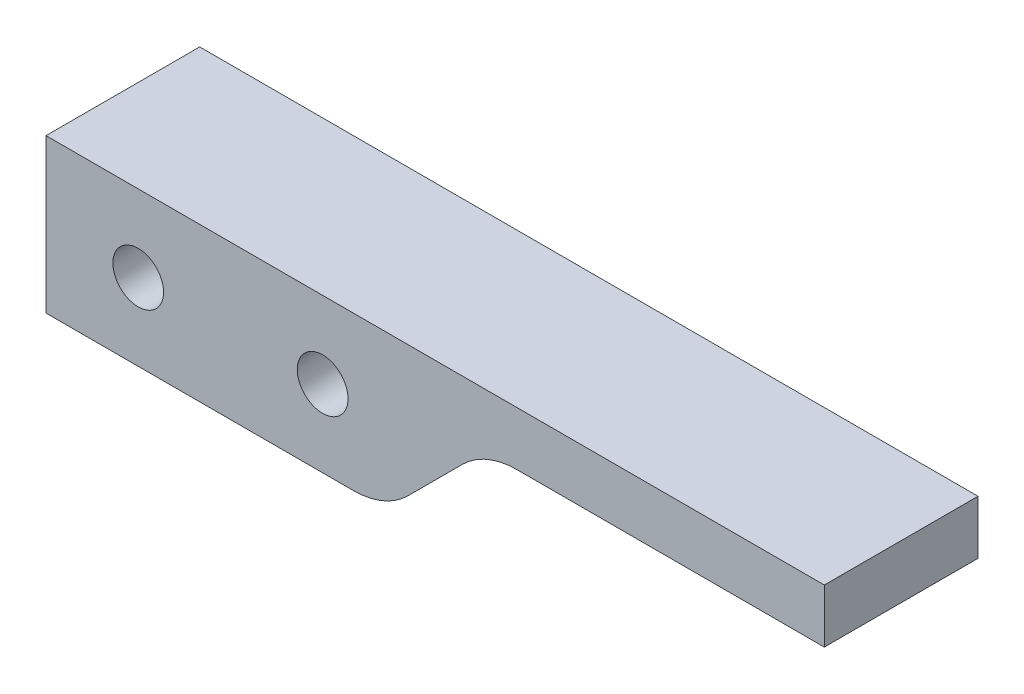
ISO-10303-21;
HEADER;
FILE_DESCRIPTION(('STEP AP214'),'2;1');
FILE_NAME('part.step','',(''),(''),'','','');
FILE_SCHEMA(('AUTOMOTIVE_DESIGN { 1 0 10303 214 1 1 1 1 }'));
ENDSEC;
DATA;
#1=APPLICATION_CONTEXT('core data for automotive mechanical design processes');
#2=APPLICATION_PROTOCOL_DEFINITION('international standard','automotive_design',2000,#1);
#3=PRODUCT_CONTEXT('',#1,'mechanical');
#4=PRODUCT('Part','Part','',(#3));
#5=PRODUCT_RELATED_PRODUCT_CATEGORY('part','',(#4));
#6=PRODUCT_DEFINITION_FORMATION('','',#4);
#7=PRODUCT_DEFINITION_CONTEXT('part definition',#1,'design');
#8=PRODUCT_DEFINITION('design','',#6,#7);
#9=PRODUCT_DEFINITION_SHAPE('','',#8);
#10=(LENGTH_UNIT() NAMED_UNIT(*) SI_UNIT(.MILLI.,.METRE.));
#11=(NAMED_UNIT(*) PLANE_ANGLE_UNIT() SI_UNIT($,.RADIAN.));
#12=(NAMED_UNIT(*) SI_UNIT($,.STERADIAN.) SOLID_ANGLE_UNIT());
#13=UNCERTAINTY_MEASURE_WITH_UNIT(LENGTH_MEASURE(1.E-05),#10,'distance_accuracy_value','');
#14=(GEOMETRIC_REPRESENTATION_CONTEXT(3) GLOBAL_UNCERTAINTY_ASSIGNED_CONTEXT((#13)) GLOBAL_UNIT_ASSIGNED_CONTEXT((#10,
#11,#12)) REPRESENTATION_CONTEXT('',''));
#15=CARTESIAN_POINT('',(0.,0.,0.));
#16=DIRECTION('',(0.,0.,1.));
#17=DIRECTION('',(1.,0.,0.));
#18=AXIS2_PLACEMENT_3D('',#15,#16,#17);
#19=CARTESIAN_POINT('',(7.74915646446561E-13,44.6708456522269,10.));
#20=DIRECTION('',(0.,1.,0.));
#21=DIRECTION('',(-1.,0.,0.));
#22=AXIS2_PLACEMENT_3D('',#19,#20,#21);
#23=PLANE('',#22);
#24=DIRECTION('',(1.,0.,0.));
#25=VECTOR('',#24,1.);
#26=CARTESIAN_POINT('',(7.74915646446561E-13,44.6708456522269,0.));
#27=LINE('',#26,#25);
#28=CARTESIAN_POINT('',(7834.71588953571,44.670845652091,0.));
#29=VERTEX_POINT('',#28);
#30=CARTESIAN_POINT('',(7854.7158895357,44.6708456520906,0.));
#31=VERTEX_POINT('',#30);
#32=EDGE_CURVE('E134',#29,#31,#27,.T.);
#33=ORIENTED_EDGE('',*,*,#32,.T.);
#34=DIRECTION('',(0.,0.,-1.));
#35=VECTOR('',#34,1.);
#36=CARTESIAN_POINT('',(7854.7158895357,44.6708456520906,10.));
#37=LINE('',#36,#35);
#38=CARTESIAN_POINT('',(7854.7158895357,44.6708456520906,10.));
#39=VERTEX_POINT('',#38);
#40=EDGE_CURVE('E11',#39,#31,#37,.T.);
#41=ORIENTED_EDGE('',*,*,#40,.F.);
#42=DIRECTION('',(1.,0.,0.));
#43=VECTOR('',#42,1.);
#44=CARTESIAN_POINT('',(7.74915646446561E-13,44.6708456522269,10.));
#45=LINE('',#44,#43);
#46=CARTESIAN_POINT('',(7834.71588953571,44.670845652091,10.));
#47=VERTEX_POINT('',#46);
#48=EDGE_CURVE('E151',#47,#39,#45,.T.);
#49=ORIENTED_EDGE('',*,*,#48,.F.);
#50=DIRECTION('',(0.,0.,-1.));
#51=VECTOR('',#50,1.);
#52=CARTESIAN_POINT('',(7834.71588953571,44.670845652091,10.));
#53=LINE('',#52,#51);
#54=EDGE_CURVE('E130',#47,#29,#53,.T.);
#55=ORIENTED_EDGE('',*,*,#54,.T.);
#56=EDGE_LOOP('',(#33,#41,#49,#55));
#57=FACE_BOUND('',#56,.T.);
#58=ADVANCED_FACE('F37',(#57),#23,.F.);
#59=CARTESIAN_POINT('',(7854.7158895357,49.670845652091,10.));
#60=DIRECTION('',(0.,0.,-1.));
#61=DIRECTION('',(-1.,0.,0.));
#62=AXIS2_PLACEMENT_3D('',#59,#60,#61);
#63=CYLINDRICAL_SURFACE('',#62,5.00000000000038);
#64=CARTESIAN_POINT('',(7854.7158895357,49.670845652091,0.));
#65=DIRECTION('',(0.,0.,1.));
#66=DIRECTION('',(1.,0.,0.));
#67=AXIS2_PLACEMENT_3D('',#64,#65,#66);
#68=CIRCLE('',#67,5.00000000000038);
#69=CARTESIAN_POINT('',(7858.25142344164,46.1353117461583,0.));
#70=VERTEX_POINT('',#69);
#71=EDGE_CURVE('E137',#31,#70,#68,.T.);
#72=ORIENTED_EDGE('',*,*,#71,.T.);
#73=DIRECTION('',(0.,0.,-1.));
#74=VECTOR('',#73,1.);
#75=CARTESIAN_POINT('',(7858.25142344164,46.1353117461583,10.));
#76=LINE('',#75,#74);
#77=CARTESIAN_POINT('',(7858.25142344164,46.1353117461583,10.));
#78=VERTEX_POINT('',#77);
#79=EDGE_CURVE('E45',#78,#70,#76,.T.);
#80=ORIENTED_EDGE('',*,*,#79,.F.);
#81=CARTESIAN_POINT('',(7854.7158895357,49.670845652091,10.));
#82=DIRECTION('',(0.,0.,1.));
#83=DIRECTION('',(1.,0.,0.));
#84=AXIS2_PLACEMENT_3D('',#81,#82,#83);
#85=CIRCLE('',#84,5.00000000000038);
#86=EDGE_CURVE('E96',#39,#78,#85,.T.);
#87=ORIENTED_EDGE('',*,*,#86,.F.);
#88=ORIENTED_EDGE('',*,*,#40,.T.);
#89=EDGE_LOOP('',(#72,#80,#87,#88));
#90=FACE_BOUND('',#89,.T.);
#91=ADVANCED_FACE('F213',(#90),#63,.T.);
#92=CARTESIAN_POINT('',(3906.0580558477,-3906.05805584774,10.));
#93=DIRECTION('',(-0.707106781186544,0.707106781186551,0.));
#94=DIRECTION('',(-0.707106781186551,-0.707106781186544,0.));
#95=AXIS2_PLACEMENT_3D('',#92,#93,#94);
#96=PLANE('',#95);
#97=DIRECTION('',(0.707106781186551,0.707106781186544,0.));
#98=VECTOR('',#97,1.);
#99=CARTESIAN_POINT('',(3906.0580558477,-3906.05805584774,0.));
#100=LINE('',#99,#98);
#101=CARTESIAN_POINT('',(7861.8224912535,49.7063795580219,0.));
#102=VERTEX_POINT('',#101);
#103=EDGE_CURVE('E140',#70,#102,#100,.T.);
#104=ORIENTED_EDGE('',*,*,#103,.T.);
#105=DIRECTION('',(0.,0.,-1.));
#106=VECTOR('',#105,1.);
#107=CARTESIAN_POINT('',(7861.8224912535,49.7063795580219,10.));
#108=LINE('',#107,#106);
#109=CARTESIAN_POINT('',(7861.8224912535,49.7063795580219,10.));
#110=VERTEX_POINT('',#109);
#111=EDGE_CURVE('E157',#110,#102,#108,.T.);
#112=ORIENTED_EDGE('',*,*,#111,.F.);
#113=DIRECTION('',(0.707106781186551,0.707106781186544,0.));
#114=VECTOR('',#113,1.);
#115=CARTESIAN_POINT('',(3906.0580558477,-3906.05805584774,10.));
#116=LINE('',#115,#114);
#117=EDGE_CURVE('E164',#78,#110,#116,.T.);
#118=ORIENTED_EDGE('',*,*,#117,.F.);
#119=ORIENTED_EDGE('',*,*,#79,.T.);
#120=EDGE_LOOP('',(#104,#112,#118,#119));
#121=FACE_BOUND('',#120,.T.);
#122=ADVANCED_FACE('F162',(#121),#96,.F.);
#123=CARTESIAN_POINT('',(7865.35802515943,46.1708456520906,10.));
#124=DIRECTION('',(0.,0.,-1.));
#125=DIRECTION('',(-1.,0.,0.));
#126=AXIS2_PLACEMENT_3D('',#123,#124,#125);
#127=CYLINDRICAL_SURFACE('',#126,4.99999999999979);
#128=CARTESIAN_POINT('',(7865.35802515943,46.1708456520906,0.));
#129=DIRECTION('',(0.,0.,1.));
#130=DIRECTION('',(1.,0.,0.));
#131=AXIS2_PLACEMENT_3D('',#128,#129,#130);
#132=CIRCLE('',#131,4.99999999999979);
#133=CARTESIAN_POINT('',(7865.35802515944,51.1708456520905,0.));
#134=VERTEX_POINT('',#133);
#135=EDGE_CURVE('E143',#134,#102,#132,.T.);
#136=ORIENTED_EDGE('',*,*,#135,.F.);
#137=DIRECTION('',(0.,0.,-1.));
#138=VECTOR('',#137,1.);
#139=CARTESIAN_POINT('',(7865.35802515944,51.1708456520905,10.));
#140=LINE('',#139,#138);
#141=CARTESIAN_POINT('',(7865.35802515944,51.1708456520905,10.));
#142=VERTEX_POINT('',#141);
#143=EDGE_CURVE('E155',#142,#134,#140,.T.);
#144=ORIENTED_EDGE('',*,*,#143,.F.);
#145=CARTESIAN_POINT('',(7865.35802515943,46.1708456520906,10.));
#146=DIRECTION('',(0.,0.,1.));
#147=DIRECTION('',(1.,0.,0.));
#148=AXIS2_PLACEMENT_3D('',#145,#146,#147);
#149=CIRCLE('',#148,4.99999999999979);
#150=EDGE_CURVE('E173',#142,#110,#149,.T.);
#151=ORIENTED_EDGE('',*,*,#150,.T.);
#152=ORIENTED_EDGE('',*,*,#111,.T.);
#153=EDGE_LOOP('',(#136,#144,#151,#152));
#154=FACE_BOUND('',#153,.T.);
#155=ADVANCED_FACE('F171',(#154),#127,.F.);
#156=CARTESIAN_POINT('',(0.,51.1708456520905,10.));
#157=DIRECTION('',(0.,1.,0.));
#158=DIRECTION('',(0.,0.,1.));
#159=AXIS2_PLACEMENT_3D('',#156,#157,#158);
#160=PLANE('',#159);
#161=DIRECTION('',(1.,0.,0.));
#162=VECTOR('',#161,1.);
#163=CARTESIAN_POINT('',(0.,51.1708456520905,0.));
#164=LINE('',#163,#162);
#165=CARTESIAN_POINT('',(7885.35802515944,51.1708456520905,0.));
#166=VERTEX_POINT('',#165);
#167=EDGE_CURVE('E146',#134,#166,#164,.T.);
#168=ORIENTED_EDGE('',*,*,#167,.T.);
#169=DIRECTION('',(0.,0.,-1.));
#170=VECTOR('',#169,1.);
#171=CARTESIAN_POINT('',(7885.35802515944,51.1708456520905,10.));
#172=LINE('',#171,#170);
#173=CARTESIAN_POINT('',(7885.35802515944,51.1708456520905,10.));
#174=VERTEX_POINT('',#173);
#175=EDGE_CURVE('E125',#174,#166,#172,.T.);
#176=ORIENTED_EDGE('',*,*,#175,.F.);
#177=DIRECTION('',(1.,0.,0.));
#178=VECTOR('',#177,1.);
#179=CARTESIAN_POINT('',(0.,51.1708456520905,10.));
#180=LINE('',#179,#178);
#181=EDGE_CURVE('E116',#142,#174,#180,.T.);
#182=ORIENTED_EDGE('',*,*,#181,.F.);
#183=ORIENTED_EDGE('',*,*,#143,.T.);
#184=EDGE_LOOP('',(#168,#176,#182,#183));
#185=FACE_BOUND('',#184,.T.);
#186=ADVANCED_FACE('F229',(#185),#160,.F.);
#187=CARTESIAN_POINT('',(7885.35802515944,0.,10.));
#188=DIRECTION('',(-1.,0.,0.));
#189=DIRECTION('',(0.,0.,1.));
#190=AXIS2_PLACEMENT_3D('',#187,#188,#189);
#191=PLANE('',#190);
#192=DIRECTION('',(0.,1.,0.));
#193=VECTOR('',#192,1.);
#194=CARTESIAN_POINT('',(7885.35802515944,0.,0.));
#195=LINE('',#194,#193);
#196=CARTESIAN_POINT('',(7885.35802515944,54.6708456520905,0.));
#197=VERTEX_POINT('',#196);
#198=EDGE_CURVE('E124',#166,#197,#195,.T.);
#199=ORIENTED_EDGE('',*,*,#198,.T.);
#200=DIRECTION('',(0.,0.,-1.));
#201=VECTOR('',#200,1.);
#202=CARTESIAN_POINT('',(7885.35802515944,54.6708456520905,10.));
#203=LINE('',#202,#201);
#204=CARTESIAN_POINT('',(7885.35802515944,54.6708456520905,10.));
#205=VERTEX_POINT('',#204);
#206=EDGE_CURVE('E121',#205,#197,#203,.T.);
#207=ORIENTED_EDGE('',*,*,#206,.F.);
#208=DIRECTION('',(0.,1.,0.));
#209=VECTOR('',#208,1.);
#210=CARTESIAN_POINT('',(7885.35802515944,0.,10.));
#211=LINE('',#210,#209);
#212=EDGE_CURVE('E109',#174,#205,#211,.T.);
#213=ORIENTED_EDGE('',*,*,#212,.F.);
#214=ORIENTED_EDGE('',*,*,#175,.T.);
#215=EDGE_LOOP('',(#199,#207,#213,#214));
#216=FACE_BOUND('',#215,.T.);
#217=ADVANCED_FACE('F122',(#216),#191,.F.);
#218=CARTESIAN_POINT('',(0.,54.6708456520905,10.));
#219=DIRECTION('',(0.,-1.,0.));
#220=DIRECTION('',(0.,0.,-1.));
#221=AXIS2_PLACEMENT_3D('',#218,#219,#220);
#222=PLANE('',#221);
#223=DIRECTION('',(-1.,0.,0.));
#224=VECTOR('',#223,1.);
#225=CARTESIAN_POINT('',(0.,54.6708456520905,0.));
#226=LINE('',#225,#224);
#227=CARTESIAN_POINT('',(7834.71588953571,54.6708456520905,0.));
#228=VERTEX_POINT('',#227);
#229=EDGE_CURVE('E82',#197,#228,#226,.T.);
#230=ORIENTED_EDGE('',*,*,#229,.T.);
#231=DIRECTION('',(0.,0.,-1.));
#232=VECTOR('',#231,1.);
#233=CARTESIAN_POINT('',(7834.71588953571,54.6708456520905,10.));
#234=LINE('',#233,#232);
#235=CARTESIAN_POINT('',(7834.71588953571,54.6708456520905,10.));
#236=VERTEX_POINT('',#235);
#237=EDGE_CURVE('E126',#236,#228,#234,.T.);
#238=ORIENTED_EDGE('',*,*,#237,.F.);
#239=DIRECTION('',(-1.,0.,0.));
#240=VECTOR('',#239,1.);
#241=CARTESIAN_POINT('',(0.,54.6708456520905,10.));
#242=LINE('',#241,#240);
#243=EDGE_CURVE('E113',#205,#236,#242,.T.);
#244=ORIENTED_EDGE('',*,*,#243,.F.);
#245=ORIENTED_EDGE('',*,*,#206,.T.);
#246=EDGE_LOOP('',(#230,#238,#244,#245));
#247=FACE_BOUND('',#246,.T.);
#248=ADVANCED_FACE('F128',(#247),#222,.F.);
#249=CARTESIAN_POINT('',(7834.71588953571,0.,10.));
#250=DIRECTION('',(1.,0.,0.));
#251=DIRECTION('',(0.,0.,-1.));
#252=AXIS2_PLACEMENT_3D('',#249,#250,#251);
#253=PLANE('',#252);
#254=DIRECTION('',(0.,-1.,0.));
#255=VECTOR('',#254,1.);
#256=CARTESIAN_POINT('',(7834.71588953571,0.,0.));
#257=LINE('',#256,#255);
#258=EDGE_CURVE('E88',#228,#29,#257,.T.);
#259=ORIENTED_EDGE('',*,*,#258,.T.);
#260=ORIENTED_EDGE('',*,*,#54,.F.);
#261=DIRECTION('',(0.,-1.,0.));
#262=VECTOR('',#261,1.);
#263=CARTESIAN_POINT('',(7834.71588953571,0.,10.));
#264=LINE('',#263,#262);
#265=EDGE_CURVE('E53',#236,#47,#264,.T.);
#266=ORIENTED_EDGE('',*,*,#265,.F.);
#267=ORIENTED_EDGE('',*,*,#237,.T.);
#268=EDGE_LOOP('',(#259,#260,#266,#267));
#269=FACE_BOUND('',#268,.T.);
#270=ADVANCED_FACE('F195',(#269),#253,.F.);
#271=CARTESIAN_POINT('',(0.,0.,10.));
#272=DIRECTION('',(0.,0.,1.));
#273=DIRECTION('',(1.,0.,0.));
#274=AXIS2_PLACEMENT_3D('',#271,#272,#273);
#275=PLANE('',#274);
#276=CARTESIAN_POINT('',(7840.71588953571,49.6708456520905,10.));
#277=DIRECTION('',(0.,0.,1.));
#278=DIRECTION('',(1.,0.,0.));
#279=AXIS2_PLACEMENT_3D('',#276,#277,#278);
#280=CIRCLE('',#279,1.64999999999971);
#281=CARTESIAN_POINT('',(7842.3658895357,49.6708456520905,10.));
#282=VERTEX_POINT('',#281);
#283=EDGE_CURVE('E187',#282,#282,#280,.T.);
#284=ORIENTED_EDGE('',*,*,#283,.F.);
#285=EDGE_LOOP('',(#284));
#286=FACE_BOUND('',#285,.T.);
#287=CARTESIAN_POINT('',(7852.7158895357,49.6708456520905,10.));
#288=DIRECTION('',(0.,0.,1.));
#289=DIRECTION('',(1.,0.,0.));
#290=AXIS2_PLACEMENT_3D('',#287,#288,#289);
#291=CIRCLE('',#290,1.64999999999971);
#292=CARTESIAN_POINT('',(7854.3658895357,49.6708456520905,10.));
#293=VERTEX_POINT('',#292);
#294=EDGE_CURVE('E181',#293,#293,#291,.T.);
#295=ORIENTED_EDGE('',*,*,#294,.F.);
#296=EDGE_LOOP('',(#295));
#297=FACE_BOUND('',#296,.T.);
#298=ORIENTED_EDGE('',*,*,#48,.T.);
#299=ORIENTED_EDGE('',*,*,#86,.T.);
#300=ORIENTED_EDGE('',*,*,#117,.T.);
#301=ORIENTED_EDGE('',*,*,#150,.F.);
#302=ORIENTED_EDGE('',*,*,#181,.T.);
#303=ORIENTED_EDGE('',*,*,#212,.T.);
#304=ORIENTED_EDGE('',*,*,#243,.T.);
#305=ORIENTED_EDGE('',*,*,#265,.T.);
#306=EDGE_LOOP('',(#298,#299,#300,#301,#302,#303,#304,#305));
#307=FACE_BOUND('',#306,.T.);
#308=ADVANCED_FACE('F111',(#286,#297,#307),#275,.T.);
#309=CARTESIAN_POINT('',(0.,0.,0.));
#310=DIRECTION('',(0.,0.,1.));
#311=DIRECTION('',(1.,0.,0.));
#312=AXIS2_PLACEMENT_3D('',#309,#310,#311);
#313=PLANE('',#312);
#314=CARTESIAN_POINT('',(7840.71588953571,49.6708456520905,0.));
#315=DIRECTION('',(0.,0.,1.));
#316=DIRECTION('',(1.,0.,0.));
#317=AXIS2_PLACEMENT_3D('',#314,#315,#316);
#318=CIRCLE('',#317,1.64999999999971);
#319=CARTESIAN_POINT('',(7842.3658895357,49.6708456520905,0.));
#320=VERTEX_POINT('',#319);
#321=EDGE_CURVE('E184',#320,#320,#318,.T.);
#322=ORIENTED_EDGE('',*,*,#321,.T.);
#323=EDGE_LOOP('',(#322));
#324=FACE_BOUND('',#323,.T.);
#325=CARTESIAN_POINT('',(7852.7158895357,49.6708456520905,0.));
#326=DIRECTION('',(0.,0.,1.));
#327=DIRECTION('',(1.,0.,0.));
#328=AXIS2_PLACEMENT_3D('',#325,#326,#327);
#329=CIRCLE('',#328,1.64999999999971);
#330=CARTESIAN_POINT('',(7854.3658895357,49.6708456520905,0.));
#331=VERTEX_POINT('',#330);
#332=EDGE_CURVE('E138',#331,#331,#329,.T.);
#333=ORIENTED_EDGE('',*,*,#332,.T.);
#334=EDGE_LOOP('',(#333));
#335=FACE_BOUND('',#334,.T.);
#336=ORIENTED_EDGE('',*,*,#32,.F.);
#337=ORIENTED_EDGE('',*,*,#258,.F.);
#338=ORIENTED_EDGE('',*,*,#229,.F.);
#339=ORIENTED_EDGE('',*,*,#198,.F.);
#340=ORIENTED_EDGE('',*,*,#167,.F.);
#341=ORIENTED_EDGE('',*,*,#135,.T.);
#342=ORIENTED_EDGE('',*,*,#103,.F.);
#343=ORIENTED_EDGE('',*,*,#71,.F.);
#344=EDGE_LOOP('',(#336,#337,#338,#339,#340,#341,#342,#343));
#345=FACE_BOUND('',#344,.T.);
#346=ADVANCED_FACE('F167',(#324,#335,#345),#313,.F.);
#347=CARTESIAN_POINT('',(7852.7158895357,49.6708456520905,10.));
#348=DIRECTION('',(0.,0.,1.));
#349=DIRECTION('',(1.,0.,0.));
#350=AXIS2_PLACEMENT_3D('',#347,#348,#349);
#351=CYLINDRICAL_SURFACE('',#350,1.64999999999971);
#352=ORIENTED_EDGE('',*,*,#332,.F.);
#353=EDGE_LOOP('',(#352));
#354=FACE_BOUND('',#353,.T.);
#355=ORIENTED_EDGE('',*,*,#294,.T.);
#356=EDGE_LOOP('',(#355));
#357=FACE_BOUND('',#356,.T.);
#358=ADVANCED_FACE('F199',(#354,#357),#351,.F.);
#359=CARTESIAN_POINT('',(7840.71588953571,49.6708456520905,10.));
#360=DIRECTION('',(0.,0.,1.));
#361=DIRECTION('',(1.,0.,0.));
#362=AXIS2_PLACEMENT_3D('',#359,#360,#361);
#363=CYLINDRICAL_SURFACE('',#362,1.64999999999971);
#364=ORIENTED_EDGE('',*,*,#321,.F.);
#365=EDGE_LOOP('',(#364));
#366=FACE_BOUND('',#365,.T.);
#367=ORIENTED_EDGE('',*,*,#283,.T.);
#368=EDGE_LOOP('',(#367));
#369=FACE_BOUND('',#368,.T.);
#370=ADVANCED_FACE('F191',(#366,#369),#363,.F.);
#371=CLOSED_SHELL('',(#58,#91,#122,#155,#186,#217,#248,#270,#308,#346,#358,#370));
#372=MANIFOLD_SOLID_BREP('B2',#371);
#373=ADVANCED_BREP_SHAPE_REPRESENTATION('',(#18,#372),#14);
#374=SHAPE_DEFINITION_REPRESENTATION(#9,#373);
ENDSEC;
END-ISO-10303-21;
